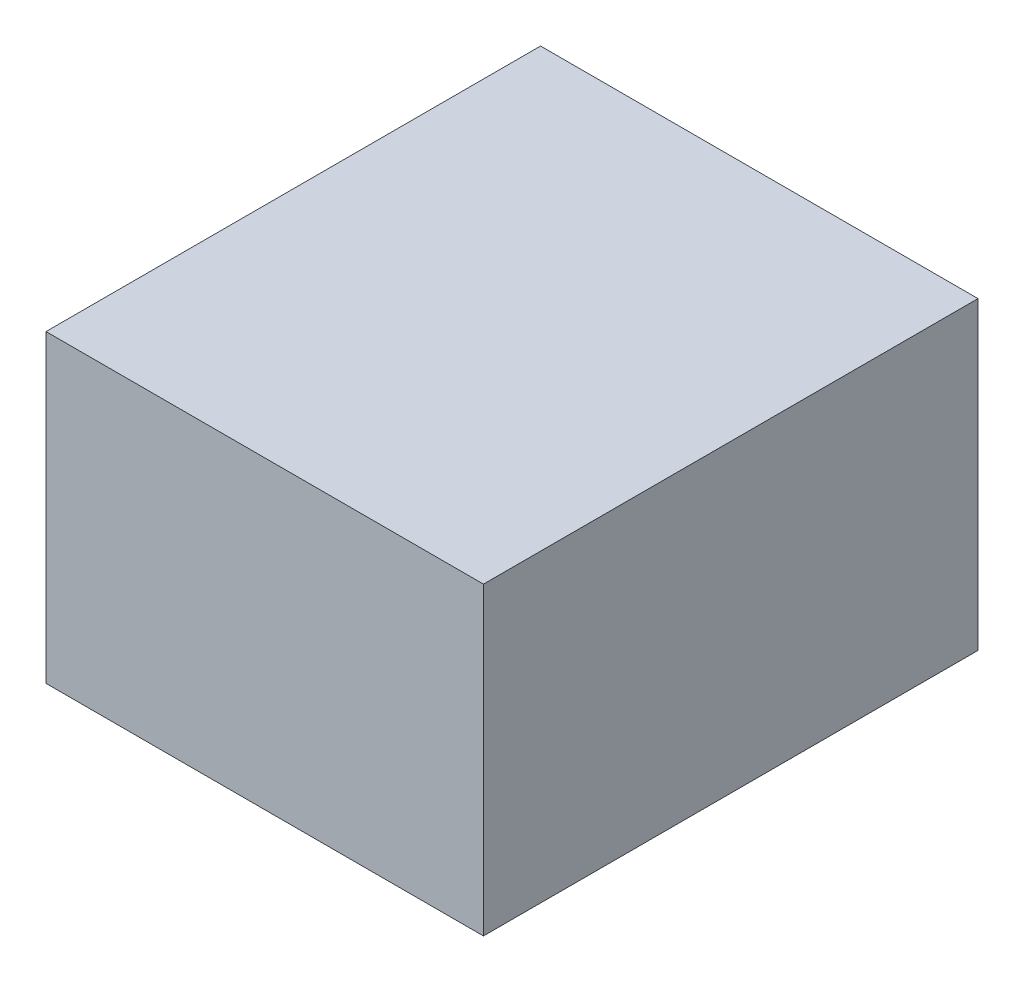
ISO-10303-21;
HEADER;
FILE_DESCRIPTION(('STEP AP214'),'2;1');
FILE_NAME('part.step','',(''),(''),'','','');
FILE_SCHEMA(('AUTOMOTIVE_DESIGN { 1 0 10303 214 1 1 1 1 }'));
ENDSEC;
DATA;
#1=APPLICATION_CONTEXT('core data for automotive mechanical design processes');
#2=APPLICATION_PROTOCOL_DEFINITION('international standard','automotive_design',2000,#1);
#3=PRODUCT_CONTEXT('',#1,'mechanical');
#4=PRODUCT('Part','Part','',(#3));
#5=PRODUCT_RELATED_PRODUCT_CATEGORY('part','',(#4));
#6=PRODUCT_DEFINITION_FORMATION('','',#4);
#7=PRODUCT_DEFINITION_CONTEXT('part definition',#1,'design');
#8=PRODUCT_DEFINITION('design','',#6,#7);
#9=PRODUCT_DEFINITION_SHAPE('','',#8);
#10=(LENGTH_UNIT() NAMED_UNIT(*) SI_UNIT(.MILLI.,.METRE.));
#11=(NAMED_UNIT(*) PLANE_ANGLE_UNIT() SI_UNIT($,.RADIAN.));
#12=(NAMED_UNIT(*) SI_UNIT($,.STERADIAN.) SOLID_ANGLE_UNIT());
#13=UNCERTAINTY_MEASURE_WITH_UNIT(LENGTH_MEASURE(1.E-05),#10,'distance_accuracy_value','');
#14=(GEOMETRIC_REPRESENTATION_CONTEXT(3) GLOBAL_UNCERTAINTY_ASSIGNED_CONTEXT((#13)) GLOBAL_UNIT_ASSIGNED_CONTEXT((#10,
#11,#12)) REPRESENTATION_CONTEXT('',''));
#15=CARTESIAN_POINT('',(0.,0.,0.));
#16=DIRECTION('',(0.,0.,1.));
#17=DIRECTION('',(1.,0.,0.));
#18=AXIS2_PLACEMENT_3D('',#15,#16,#17);
#19=CARTESIAN_POINT('',(-13.69022662,-9.55048636,0.));
#20=DIRECTION('',(-0.707106781187048,-0.707106781186048,0.));
#21=DIRECTION('',(0.707106781186048,-0.707106781187048,0.));
#22=AXIS2_PLACEMENT_3D('',#19,#20,#21);
#23=PLANE('',#22);
#24=DIRECTION('',(0.,0.,1.));
#25=VECTOR('',#24,1.);
#26=CARTESIAN_POINT('',(-13.7105263,-9.53018668,0.));
#27=LINE('',#26,#25);
#28=CARTESIAN_POINT('',(-13.7105263,-9.53018667999999,0.));
#29=VERTEX_POINT('',#28);
#30=CARTESIAN_POINT('',(-13.7105263,-9.53018667999999,30.99999896));
#31=VERTEX_POINT('',#30);
#32=EDGE_CURVE('E71',#29,#31,#27,.T.);
#33=ORIENTED_EDGE('',*,*,#32,.F.);
#34=DIRECTION('',(0.707106781186048,-0.707106781187048,0.));
#35=VECTOR('',#34,1.);
#36=CARTESIAN_POINT('',(-13.69022662,-9.55048636,0.));
#37=LINE('',#36,#35);
#38=CARTESIAN_POINT('',(-13.69022662,-9.55048636,0.));
#39=VERTEX_POINT('',#38);
#40=EDGE_CURVE('E102',#29,#39,#37,.T.);
#41=ORIENTED_EDGE('',*,*,#40,.T.);
#42=DIRECTION('',(0.,0.,-1.));
#43=VECTOR('',#42,1.);
#44=CARTESIAN_POINT('',(-13.69022662,-9.55048636,0.));
#45=LINE('',#44,#43);
#46=CARTESIAN_POINT('',(-13.69022662,-9.55048636,30.99999896));
#47=VERTEX_POINT('',#46);
#48=EDGE_CURVE('E100',#47,#39,#45,.T.);
#49=ORIENTED_EDGE('',*,*,#48,.F.);
#50=DIRECTION('',(0.707106781186048,-0.707106781187048,0.));
#51=VECTOR('',#50,1.);
#52=CARTESIAN_POINT('',(-13.69022662,-9.55048636,30.99999896));
#53=LINE('',#52,#51);
#54=EDGE_CURVE('E66',#47,#31,#53,.F.);
#55=ORIENTED_EDGE('',*,*,#54,.T.);
#56=EDGE_LOOP('',(#33,#41,#49,#55));
#57=FACE_BOUND('',#56,.T.);
#58=ADVANCED_FACE('F17',(#57),#23,.T.);
#59=CARTESIAN_POINT('',(13.7099802,-9.55048636,0.));
#60=DIRECTION('',(0.,-1.,0.));
#61=DIRECTION('',(0.,0.,-1.));
#62=AXIS2_PLACEMENT_3D('',#59,#60,#61);
#63=PLANE('',#62);
#64=ORIENTED_EDGE('',*,*,#48,.T.);
#65=DIRECTION('',(1.,0.,0.));
#66=VECTOR('',#65,1.);
#67=CARTESIAN_POINT('',(13.7099802,-9.55048636,0.));
#68=LINE('',#67,#66);
#69=CARTESIAN_POINT('',(13.7099802005404,-9.55048636,0.));
#70=VERTEX_POINT('',#69);
#71=EDGE_CURVE('E76',#39,#70,#68,.T.);
#72=ORIENTED_EDGE('',*,*,#71,.T.);
#73=DIRECTION('',(0.,0.,-1.));
#74=VECTOR('',#73,1.);
#75=CARTESIAN_POINT('',(13.7099802010808,-9.55048636,0.));
#76=LINE('',#75,#74);
#77=CARTESIAN_POINT('',(13.7099802010808,-9.55048636,30.99999896));
#78=VERTEX_POINT('',#77);
#79=EDGE_CURVE('E20',#78,#70,#76,.T.);
#80=ORIENTED_EDGE('',*,*,#79,.F.);
#81=DIRECTION('',(1.,0.,0.));
#82=VECTOR('',#81,1.);
#83=CARTESIAN_POINT('',(13.7099802,-9.55048636,30.99999896));
#84=LINE('',#83,#82);
#85=EDGE_CURVE('E59',#47,#78,#84,.T.);
#86=ORIENTED_EDGE('',*,*,#85,.F.);
#87=EDGE_LOOP('',(#64,#72,#80,#86));
#88=FACE_BOUND('',#87,.T.);
#89=ADVANCED_FACE('F74',(#88),#63,.T.);
#90=CARTESIAN_POINT('',(-13.7105263,-9.53018668,0.));
#91=DIRECTION('',(-1.,0.,0.));
#92=DIRECTION('',(0.,0.,1.));
#93=AXIS2_PLACEMENT_3D('',#90,#91,#92);
#94=PLANE('',#93);
#95=DIRECTION('',(0.,0.,1.));
#96=VECTOR('',#95,1.);
#97=CARTESIAN_POINT('',(-13.7105263,9.55052954,0.));
#98=LINE('',#97,#96);
#99=CARTESIAN_POINT('',(-13.7105263,9.55052954,0.));
#100=VERTEX_POINT('',#99);
#101=CARTESIAN_POINT('',(-13.7105263,9.55052954,30.99999896));
#102=VERTEX_POINT('',#101);
#103=EDGE_CURVE('E84',#100,#102,#98,.T.);
#104=ORIENTED_EDGE('',*,*,#103,.F.);
#105=DIRECTION('',(0.,1.,0.));
#106=VECTOR('',#105,1.);
#107=CARTESIAN_POINT('',(-13.7105263,-9.55048636,0.));
#108=LINE('',#107,#106);
#109=EDGE_CURVE('E91',#100,#29,#108,.F.);
#110=ORIENTED_EDGE('',*,*,#109,.T.);
#111=ORIENTED_EDGE('',*,*,#32,.T.);
#112=DIRECTION('',(0.,1.,0.));
#113=VECTOR('',#112,1.);
#114=CARTESIAN_POINT('',(-13.7105263,-9.55048636,30.99999896));
#115=LINE('',#114,#113);
#116=EDGE_CURVE('E70',#102,#31,#115,.F.);
#117=ORIENTED_EDGE('',*,*,#116,.F.);
#118=EDGE_LOOP('',(#104,#110,#111,#117));
#119=FACE_BOUND('',#118,.T.);
#120=ADVANCED_FACE('F131',(#119),#94,.T.);
#121=CARTESIAN_POINT('',(13.7099802,-9.55048636,30.99999896));
#122=DIRECTION('',(0.,0.,1.));
#123=DIRECTION('',(1.,0.,0.));
#124=AXIS2_PLACEMENT_3D('',#121,#122,#123);
#125=PLANE('',#124);
#126=ORIENTED_EDGE('',*,*,#116,.T.);
#127=ORIENTED_EDGE('',*,*,#54,.F.);
#128=ORIENTED_EDGE('',*,*,#85,.T.);
#129=DIRECTION('',(2.65953874740791E-05,0.999999999646343,0.));
#130=VECTOR('',#129,1.);
#131=CARTESIAN_POINT('',(13.7104882,9.55052954,30.99999896));
#132=LINE('',#131,#130);
#133=CARTESIAN_POINT('',(13.7104882,9.55052954,30.99999896));
#134=VERTEX_POINT('',#133);
#135=EDGE_CURVE('E65',#134,#78,#132,.F.);
#136=ORIENTED_EDGE('',*,*,#135,.F.);
#137=DIRECTION('',(1.,0.,0.));
#138=VECTOR('',#137,1.);
#139=CARTESIAN_POINT('',(-13.7105263,9.55052954,30.99999896));
#140=LINE('',#139,#138);
#141=EDGE_CURVE('E97',#102,#134,#140,.T.);
#142=ORIENTED_EDGE('',*,*,#141,.F.);
#143=EDGE_LOOP('',(#126,#127,#128,#136,#142));
#144=FACE_BOUND('',#143,.T.);
#145=ADVANCED_FACE('F62',(#144),#125,.T.);
#146=CARTESIAN_POINT('',(13.7104882,9.55052954,0.));
#147=DIRECTION('',(0.999999999646343,-2.65953874740791E-05,0.));
#148=DIRECTION('',(2.65953874740791E-05,0.999999999646343,0.));
#149=AXIS2_PLACEMENT_3D('',#146,#147,#148);
#150=PLANE('',#149);
#151=ORIENTED_EDGE('',*,*,#79,.T.);
#152=DIRECTION('',(2.65954440580357E-05,0.999999999646341,0.));
#153=VECTOR('',#152,1.);
#154=CARTESIAN_POINT('',(13.7099802,-9.55048636,0.));
#155=LINE('',#154,#153);
#156=CARTESIAN_POINT('',(13.7104882,9.55052954,0.));
#157=VERTEX_POINT('',#156);
#158=EDGE_CURVE('E35',#70,#157,#155,.T.);
#159=ORIENTED_EDGE('',*,*,#158,.T.);
#160=DIRECTION('',(0.,0.,1.));
#161=VECTOR('',#160,1.);
#162=CARTESIAN_POINT('',(13.7104882,9.55052954,0.));
#163=LINE('',#162,#161);
#164=EDGE_CURVE('E26',#134,#157,#163,.F.);
#165=ORIENTED_EDGE('',*,*,#164,.F.);
#166=ORIENTED_EDGE('',*,*,#135,.T.);
#167=EDGE_LOOP('',(#151,#159,#165,#166));
#168=FACE_BOUND('',#167,.T.);
#169=ADVANCED_FACE('F77',(#168),#150,.T.);
#170=CARTESIAN_POINT('',(13.7099802,-9.55048636,0.));
#171=DIRECTION('',(0.,0.,1.));
#172=DIRECTION('',(1.,0.,0.));
#173=AXIS2_PLACEMENT_3D('',#170,#171,#172);
#174=PLANE('',#173);
#175=ORIENTED_EDGE('',*,*,#109,.F.);
#176=DIRECTION('',(1.,0.,0.));
#177=VECTOR('',#176,1.);
#178=CARTESIAN_POINT('',(-13.7105263,9.55052954,0.));
#179=LINE('',#178,#177);
#180=EDGE_CURVE('E11',#157,#100,#179,.F.);
#181=ORIENTED_EDGE('',*,*,#180,.F.);
#182=ORIENTED_EDGE('',*,*,#158,.F.);
#183=ORIENTED_EDGE('',*,*,#71,.F.);
#184=ORIENTED_EDGE('',*,*,#40,.F.);
#185=EDGE_LOOP('',(#175,#181,#182,#183,#184));
#186=FACE_BOUND('',#185,.T.);
#187=ADVANCED_FACE('F133',(#186),#174,.F.);
#188=CARTESIAN_POINT('',(-13.7105263,9.55052954,0.));
#189=DIRECTION('',(0.,1.,0.));
#190=DIRECTION('',(0.,0.,1.));
#191=AXIS2_PLACEMENT_3D('',#188,#189,#190);
#192=PLANE('',#191);
#193=ORIENTED_EDGE('',*,*,#164,.T.);
#194=ORIENTED_EDGE('',*,*,#180,.T.);
#195=ORIENTED_EDGE('',*,*,#103,.T.);
#196=ORIENTED_EDGE('',*,*,#141,.T.);
#197=EDGE_LOOP('',(#193,#194,#195,#196));
#198=FACE_BOUND('',#197,.T.);
#199=ADVANCED_FACE('F129',(#198),#192,.T.);
#200=CLOSED_SHELL('',(#58,#89,#120,#145,#169,#187,#199));
#201=MANIFOLD_SOLID_BREP('B1',#200);
#202=ADVANCED_BREP_SHAPE_REPRESENTATION('',(#18,#201),#14);
#203=SHAPE_DEFINITION_REPRESENTATION(#9,#202);
ENDSEC;
END-ISO-10303-21;
